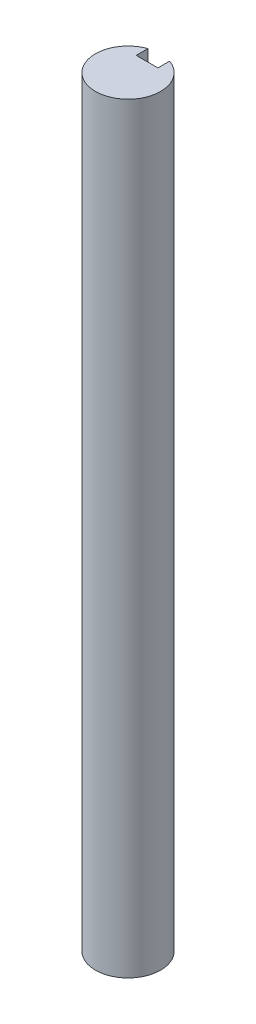
ISO-10303-21;
HEADER;
FILE_DESCRIPTION(('STEP AP214'),'2;1');
FILE_NAME('part.step','',(''),(''),'','','');
FILE_SCHEMA(('AUTOMOTIVE_DESIGN { 1 0 10303 214 1 1 1 1 }'));
ENDSEC;
DATA;
#1=APPLICATION_CONTEXT('core data for automotive mechanical design processes');
#2=APPLICATION_PROTOCOL_DEFINITION('international standard','automotive_design',2000,#1);
#3=PRODUCT_CONTEXT('',#1,'mechanical');
#4=PRODUCT('Part','Part','',(#3));
#5=PRODUCT_RELATED_PRODUCT_CATEGORY('part','',(#4));
#6=PRODUCT_DEFINITION_FORMATION('','',#4);
#7=PRODUCT_DEFINITION_CONTEXT('part definition',#1,'design');
#8=PRODUCT_DEFINITION('design','',#6,#7);
#9=PRODUCT_DEFINITION_SHAPE('','',#8);
#10=(LENGTH_UNIT() NAMED_UNIT(*) SI_UNIT(.MILLI.,.METRE.));
#11=(NAMED_UNIT(*) PLANE_ANGLE_UNIT() SI_UNIT($,.RADIAN.));
#12=(NAMED_UNIT(*) SI_UNIT($,.STERADIAN.) SOLID_ANGLE_UNIT());
#13=UNCERTAINTY_MEASURE_WITH_UNIT(LENGTH_MEASURE(1.E-05),#10,'distance_accuracy_value','');
#14=(GEOMETRIC_REPRESENTATION_CONTEXT(3) GLOBAL_UNCERTAINTY_ASSIGNED_CONTEXT((#13)) GLOBAL_UNIT_ASSIGNED_CONTEXT((#10,
#11,#12)) REPRESENTATION_CONTEXT('',''));
#15=CARTESIAN_POINT('',(0.,0.,0.));
#16=DIRECTION('',(0.,0.,1.));
#17=DIRECTION('',(1.,0.,0.));
#18=AXIS2_PLACEMENT_3D('',#15,#16,#17);
#19=CARTESIAN_POINT('',(0.,-36.,0.));
#20=DIRECTION('',(0.,1.,0.));
#21=DIRECTION('',(0.,0.,-1.));
#22=AXIS2_PLACEMENT_3D('',#19,#20,#21);
#23=PLANE('',#22);
#24=DIRECTION('',(0.,0.,-1.));
#25=VECTOR('',#24,1.);
#26=CARTESIAN_POINT('',(2.,-36.,0.));
#27=LINE('',#26,#25);
#28=CARTESIAN_POINT('',(2.,-36.,-1.));
#29=VERTEX_POINT('',#28);
#30=CARTESIAN_POINT('',(2.,-36.,-5.65685424949238));
#31=VERTEX_POINT('',#30);
#32=EDGE_CURVE('E135',#29,#31,#27,.T.);
#33=ORIENTED_EDGE('',*,*,#32,.T.);
#34=CARTESIAN_POINT('',(0.,-36.,0.));
#35=DIRECTION('',(0.,-1.,0.));
#36=DIRECTION('',(0.,0.,-1.));
#37=AXIS2_PLACEMENT_3D('',#34,#35,#36);
#38=CIRCLE('',#37,6.);
#39=CARTESIAN_POINT('',(-2.,-36.,-5.65685424949238));
#40=VERTEX_POINT('',#39);
#41=EDGE_CURVE('E182',#31,#40,#38,.T.);
#42=ORIENTED_EDGE('',*,*,#41,.T.);
#43=DIRECTION('',(0.,0.,1.));
#44=VECTOR('',#43,1.);
#45=CARTESIAN_POINT('',(-2.,-36.,0.));
#46=LINE('',#45,#44);
#47=CARTESIAN_POINT('',(-2.,-36.,-0.999999999999999));
#48=VERTEX_POINT('',#47);
#49=EDGE_CURVE('E185',#40,#48,#46,.T.);
#50=ORIENTED_EDGE('',*,*,#49,.T.);
#51=DIRECTION('',(-1.,0.,0.));
#52=VECTOR('',#51,1.);
#53=CARTESIAN_POINT('',(0.,-36.,-1.));
#54=LINE('',#53,#52);
#55=EDGE_CURVE('E130',#29,#48,#54,.T.);
#56=ORIENTED_EDGE('',*,*,#55,.F.);
#57=EDGE_LOOP('',(#33,#42,#50,#56));
#58=FACE_BOUND('',#57,.T.);
#59=ADVANCED_FACE('F37',(#58),#23,.F.);
#60=CARTESIAN_POINT('',(0.,-36.,0.));
#61=DIRECTION('',(0.,1.,0.));
#62=DIRECTION('',(0.,0.,-1.));
#63=AXIS2_PLACEMENT_3D('',#60,#61,#62);
#64=CYLINDRICAL_SURFACE('',#63,6.);
#65=CARTESIAN_POINT('',(0.,-16.,0.));
#66=DIRECTION('',(0.,-1.,0.));
#67=DIRECTION('',(0.,0.,-1.));
#68=AXIS2_PLACEMENT_3D('',#65,#66,#67);
#69=CIRCLE('',#68,6.);
#70=CARTESIAN_POINT('',(2.,-16.,-5.65685424949238));
#71=VERTEX_POINT('',#70);
#72=CARTESIAN_POINT('',(-2.,-16.,-5.65685424949238));
#73=VERTEX_POINT('',#72);
#74=EDGE_CURVE('E189',#71,#73,#69,.F.);
#75=ORIENTED_EDGE('',*,*,#74,.T.);
#76=DIRECTION('',(0.,1.,0.));
#77=VECTOR('',#76,1.);
#78=CARTESIAN_POINT('',(-2.,-36.,-5.65685424949238));
#79=LINE('',#78,#77);
#80=EDGE_CURVE('E174',#40,#73,#79,.T.);
#81=ORIENTED_EDGE('',*,*,#80,.F.);
#82=ORIENTED_EDGE('',*,*,#41,.F.);
#83=DIRECTION('',(0.,1.,0.));
#84=VECTOR('',#83,1.);
#85=CARTESIAN_POINT('',(2.,-36.,-5.65685424949238));
#86=LINE('',#85,#84);
#87=EDGE_CURVE('E177',#71,#31,#86,.F.);
#88=ORIENTED_EDGE('',*,*,#87,.F.);
#89=EDGE_LOOP('',(#75,#81,#82,#88));
#90=FACE_BOUND('',#89,.T.);
#91=CARTESIAN_POINT('',(0.,54.,0.));
#92=DIRECTION('',(0.,1.,0.));
#93=DIRECTION('',(0.,0.,1.));
#94=AXIS2_PLACEMENT_3D('',#91,#92,#93);
#95=CIRCLE('',#94,6.);
#96=CARTESIAN_POINT('',(-2.,54.,-5.65685424949238));
#97=VERTEX_POINT('',#96);
#98=CARTESIAN_POINT('',(2.,54.,-5.65685424949238));
#99=VERTEX_POINT('',#98);
#100=EDGE_CURVE('E11',#97,#99,#95,.F.);
#101=ORIENTED_EDGE('',*,*,#100,.T.);
#102=DIRECTION('',(0.,1.,0.));
#103=VECTOR('',#102,1.);
#104=CARTESIAN_POINT('',(2.,-36.,-5.65685424949238));
#105=LINE('',#104,#103);
#106=CARTESIAN_POINT('',(2.,104.,-5.65685424949238));
#107=VERTEX_POINT('',#106);
#108=EDGE_CURVE('E157',#107,#99,#105,.F.);
#109=ORIENTED_EDGE('',*,*,#108,.F.);
#110=CARTESIAN_POINT('',(0.,104.,0.));
#111=DIRECTION('',(0.,-1.,0.));
#112=DIRECTION('',(0.,0.,-1.));
#113=AXIS2_PLACEMENT_3D('',#110,#111,#112);
#114=CIRCLE('',#113,6.);
#115=CARTESIAN_POINT('',(-2.,104.,-5.65685424949238));
#116=VERTEX_POINT('',#115);
#117=EDGE_CURVE('E179',#107,#116,#114,.T.);
#118=ORIENTED_EDGE('',*,*,#117,.T.);
#119=DIRECTION('',(0.,1.,0.));
#120=VECTOR('',#119,1.);
#121=CARTESIAN_POINT('',(-2.,-36.,-5.65685424949238));
#122=LINE('',#121,#120);
#123=EDGE_CURVE('E159',#97,#116,#122,.T.);
#124=ORIENTED_EDGE('',*,*,#123,.F.);
#125=EDGE_LOOP('',(#101,#109,#118,#124));
#126=FACE_BOUND('',#125,.T.);
#127=ADVANCED_FACE('F39',(#90,#126),#64,.T.);
#128=CARTESIAN_POINT('',(0.,104.,0.));
#129=DIRECTION('',(0.,1.,0.));
#130=DIRECTION('',(0.,0.,-1.));
#131=AXIS2_PLACEMENT_3D('',#128,#129,#130);
#132=PLANE('',#131);
#133=ORIENTED_EDGE('',*,*,#117,.F.);
#134=DIRECTION('',(0.,0.,-1.));
#135=VECTOR('',#134,1.);
#136=CARTESIAN_POINT('',(2.,104.,0.));
#137=LINE('',#136,#135);
#138=CARTESIAN_POINT('',(2.,104.,-3.5));
#139=VERTEX_POINT('',#138);
#140=EDGE_CURVE('E60',#139,#107,#137,.T.);
#141=ORIENTED_EDGE('',*,*,#140,.F.);
#142=DIRECTION('',(1.,0.,0.));
#143=VECTOR('',#142,1.);
#144=CARTESIAN_POINT('',(0.,104.,-3.5));
#145=LINE('',#144,#143);
#146=CARTESIAN_POINT('',(-2.,104.,-3.5));
#147=VERTEX_POINT('',#146);
#148=EDGE_CURVE('E137',#147,#139,#145,.T.);
#149=ORIENTED_EDGE('',*,*,#148,.F.);
#150=DIRECTION('',(0.,0.,1.));
#151=VECTOR('',#150,1.);
#152=CARTESIAN_POINT('',(-2.,104.,0.));
#153=LINE('',#152,#151);
#154=EDGE_CURVE('E45',#116,#147,#153,.T.);
#155=ORIENTED_EDGE('',*,*,#154,.F.);
#156=EDGE_LOOP('',(#133,#141,#149,#155));
#157=FACE_BOUND('',#156,.T.);
#158=ADVANCED_FACE('F198',(#157),#132,.T.);
#159=CARTESIAN_POINT('',(0.,-16.,-3.5));
#160=DIRECTION('',(0.,0.,-1.));
#161=DIRECTION('',(1.,0.,0.));
#162=AXIS2_PLACEMENT_3D('',#159,#160,#161);
#163=PLANE('',#162);
#164=DIRECTION('',(-1.,0.,0.));
#165=VECTOR('',#164,1.);
#166=CARTESIAN_POINT('',(0.,-30.,-3.5));
#167=LINE('',#166,#165);
#168=CARTESIAN_POINT('',(2.,-30.,-3.5));
#169=VERTEX_POINT('',#168);
#170=CARTESIAN_POINT('',(-2.,-30.,-3.5));
#171=VERTEX_POINT('',#170);
#172=EDGE_CURVE('E129',#169,#171,#167,.T.);
#173=ORIENTED_EDGE('',*,*,#172,.T.);
#174=DIRECTION('',(0.,-1.,0.));
#175=VECTOR('',#174,1.);
#176=CARTESIAN_POINT('',(-2.,-16.,-3.5));
#177=LINE('',#176,#175);
#178=CARTESIAN_POINT('',(-2.,-16.,-3.5));
#179=VERTEX_POINT('',#178);
#180=EDGE_CURVE('E169',#179,#171,#177,.T.);
#181=ORIENTED_EDGE('',*,*,#180,.F.);
#182=DIRECTION('',(-1.,0.,0.));
#183=VECTOR('',#182,1.);
#184=CARTESIAN_POINT('',(0.,-16.,-3.5));
#185=LINE('',#184,#183);
#186=CARTESIAN_POINT('',(2.,-16.,-3.5));
#187=VERTEX_POINT('',#186);
#188=EDGE_CURVE('E164',#187,#179,#185,.T.);
#189=ORIENTED_EDGE('',*,*,#188,.F.);
#190=DIRECTION('',(0.,-1.,0.));
#191=VECTOR('',#190,1.);
#192=CARTESIAN_POINT('',(2.,-16.,-3.5));
#193=LINE('',#192,#191);
#194=EDGE_CURVE('E172',#187,#169,#193,.T.);
#195=ORIENTED_EDGE('',*,*,#194,.T.);
#196=EDGE_LOOP('',(#173,#181,#189,#195));
#197=FACE_BOUND('',#196,.T.);
#198=ADVANCED_FACE('F225',(#197),#163,.T.);
#199=CARTESIAN_POINT('',(2.,-16.,0.));
#200=DIRECTION('',(-1.,0.,0.));
#201=DIRECTION('',(0.,0.,-1.));
#202=AXIS2_PLACEMENT_3D('',#199,#200,#201);
#203=PLANE('',#202);
#204=ORIENTED_EDGE('',*,*,#194,.F.);
#205=DIRECTION('',(0.,0.,1.));
#206=VECTOR('',#205,1.);
#207=CARTESIAN_POINT('',(2.,-16.,0.));
#208=LINE('',#207,#206);
#209=EDGE_CURVE('E162',#71,#187,#208,.T.);
#210=ORIENTED_EDGE('',*,*,#209,.F.);
#211=ORIENTED_EDGE('',*,*,#87,.T.);
#212=ORIENTED_EDGE('',*,*,#32,.F.);
#213=DIRECTION('',(0.,-1.,0.));
#214=VECTOR('',#213,1.);
#215=CARTESIAN_POINT('',(2.,-30.,-1.));
#216=LINE('',#215,#214);
#217=CARTESIAN_POINT('',(2.,-30.,-1.));
#218=VERTEX_POINT('',#217);
#219=EDGE_CURVE('E119',#218,#29,#216,.T.);
#220=ORIENTED_EDGE('',*,*,#219,.F.);
#221=DIRECTION('',(0.,0.,1.));
#222=VECTOR('',#221,1.);
#223=CARTESIAN_POINT('',(2.,-30.,0.));
#224=LINE('',#223,#222);
#225=EDGE_CURVE('E52',#169,#218,#224,.T.);
#226=ORIENTED_EDGE('',*,*,#225,.F.);
#227=EDGE_LOOP('',(#204,#210,#211,#212,#220,#226));
#228=FACE_BOUND('',#227,.T.);
#229=ADVANCED_FACE('F133',(#228),#203,.T.);
#230=CARTESIAN_POINT('',(-2.,-16.,0.));
#231=DIRECTION('',(1.,0.,0.));
#232=DIRECTION('',(0.,0.,1.));
#233=AXIS2_PLACEMENT_3D('',#230,#231,#232);
#234=PLANE('',#233);
#235=DIRECTION('',(0.,0.,-1.));
#236=VECTOR('',#235,1.);
#237=CARTESIAN_POINT('',(-2.,-16.,0.));
#238=LINE('',#237,#236);
#239=EDGE_CURVE('E167',#179,#73,#238,.T.);
#240=ORIENTED_EDGE('',*,*,#239,.F.);
#241=ORIENTED_EDGE('',*,*,#180,.T.);
#242=DIRECTION('',(0.,0.,-1.));
#243=VECTOR('',#242,1.);
#244=CARTESIAN_POINT('',(-2.,-30.,0.));
#245=LINE('',#244,#243);
#246=CARTESIAN_POINT('',(-2.,-30.,-0.999999999999999));
#247=VERTEX_POINT('',#246);
#248=EDGE_CURVE('E124',#247,#171,#245,.T.);
#249=ORIENTED_EDGE('',*,*,#248,.F.);
#250=DIRECTION('',(0.,-1.,0.));
#251=VECTOR('',#250,1.);
#252=CARTESIAN_POINT('',(-2.,-30.,-0.999999999999999));
#253=LINE('',#252,#251);
#254=EDGE_CURVE('E121',#247,#48,#253,.T.);
#255=ORIENTED_EDGE('',*,*,#254,.T.);
#256=ORIENTED_EDGE('',*,*,#49,.F.);
#257=ORIENTED_EDGE('',*,*,#80,.T.);
#258=EDGE_LOOP('',(#240,#241,#249,#255,#256,#257));
#259=FACE_BOUND('',#258,.T.);
#260=ADVANCED_FACE('F228',(#259),#234,.T.);
#261=CARTESIAN_POINT('',(0.,-16.,0.));
#262=DIRECTION('',(0.,1.,0.));
#263=DIRECTION('',(0.,0.,-1.));
#264=AXIS2_PLACEMENT_3D('',#261,#262,#263);
#265=PLANE('',#264);
#266=ORIENTED_EDGE('',*,*,#74,.F.);
#267=ORIENTED_EDGE('',*,*,#209,.T.);
#268=ORIENTED_EDGE('',*,*,#188,.T.);
#269=ORIENTED_EDGE('',*,*,#239,.T.);
#270=EDGE_LOOP('',(#266,#267,#268,#269));
#271=FACE_BOUND('',#270,.T.);
#272=ADVANCED_FACE('F234',(#271),#265,.F.);
#273=CARTESIAN_POINT('',(-2.,54.,0.));
#274=DIRECTION('',(1.,0.,0.));
#275=DIRECTION('',(0.,0.,1.));
#276=AXIS2_PLACEMENT_3D('',#273,#274,#275);
#277=PLANE('',#276);
#278=DIRECTION('',(0.,0.,1.));
#279=VECTOR('',#278,1.);
#280=CARTESIAN_POINT('',(-2.,54.,0.));
#281=LINE('',#280,#279);
#282=CARTESIAN_POINT('',(-2.,54.,-3.5));
#283=VERTEX_POINT('',#282);
#284=EDGE_CURVE('E142',#97,#283,#281,.T.);
#285=ORIENTED_EDGE('',*,*,#284,.F.);
#286=ORIENTED_EDGE('',*,*,#123,.T.);
#287=ORIENTED_EDGE('',*,*,#154,.T.);
#288=DIRECTION('',(0.,1.,0.));
#289=VECTOR('',#288,1.);
#290=CARTESIAN_POINT('',(-2.,54.,-3.5));
#291=LINE('',#290,#289);
#292=EDGE_CURVE('E155',#283,#147,#291,.T.);
#293=ORIENTED_EDGE('',*,*,#292,.F.);
#294=EDGE_LOOP('',(#285,#286,#287,#293));
#295=FACE_BOUND('',#294,.T.);
#296=ADVANCED_FACE('F195',(#295),#277,.T.);
#297=CARTESIAN_POINT('',(0.,54.,-3.5));
#298=DIRECTION('',(0.,0.,-1.));
#299=DIRECTION('',(1.,0.,0.));
#300=AXIS2_PLACEMENT_3D('',#297,#298,#299);
#301=PLANE('',#300);
#302=ORIENTED_EDGE('',*,*,#148,.T.);
#303=DIRECTION('',(0.,1.,0.));
#304=VECTOR('',#303,1.);
#305=CARTESIAN_POINT('',(2.,54.,-3.5));
#306=LINE('',#305,#304);
#307=CARTESIAN_POINT('',(2.,54.,-3.5));
#308=VERTEX_POINT('',#307);
#309=EDGE_CURVE('E150',#308,#139,#306,.T.);
#310=ORIENTED_EDGE('',*,*,#309,.F.);
#311=DIRECTION('',(1.,0.,0.));
#312=VECTOR('',#311,1.);
#313=CARTESIAN_POINT('',(0.,54.,-3.5));
#314=LINE('',#313,#312);
#315=EDGE_CURVE('E145',#283,#308,#314,.T.);
#316=ORIENTED_EDGE('',*,*,#315,.F.);
#317=ORIENTED_EDGE('',*,*,#292,.T.);
#318=EDGE_LOOP('',(#302,#310,#316,#317));
#319=FACE_BOUND('',#318,.T.);
#320=ADVANCED_FACE('F201',(#319),#301,.T.);
#321=CARTESIAN_POINT('',(2.,54.,0.));
#322=DIRECTION('',(-1.,0.,0.));
#323=DIRECTION('',(0.,0.,-1.));
#324=AXIS2_PLACEMENT_3D('',#321,#322,#323);
#325=PLANE('',#324);
#326=ORIENTED_EDGE('',*,*,#140,.T.);
#327=ORIENTED_EDGE('',*,*,#108,.T.);
#328=DIRECTION('',(0.,0.,-1.));
#329=VECTOR('',#328,1.);
#330=CARTESIAN_POINT('',(2.,54.,0.));
#331=LINE('',#330,#329);
#332=EDGE_CURVE('E148',#308,#99,#331,.T.);
#333=ORIENTED_EDGE('',*,*,#332,.F.);
#334=ORIENTED_EDGE('',*,*,#309,.T.);
#335=EDGE_LOOP('',(#326,#327,#333,#334));
#336=FACE_BOUND('',#335,.T.);
#337=ADVANCED_FACE('F207',(#336),#325,.T.);
#338=CARTESIAN_POINT('',(0.,54.,0.));
#339=DIRECTION('',(0.,-1.,0.));
#340=DIRECTION('',(0.,0.,1.));
#341=AXIS2_PLACEMENT_3D('',#338,#339,#340);
#342=PLANE('',#341);
#343=ORIENTED_EDGE('',*,*,#100,.F.);
#344=ORIENTED_EDGE('',*,*,#284,.T.);
#345=ORIENTED_EDGE('',*,*,#315,.T.);
#346=ORIENTED_EDGE('',*,*,#332,.T.);
#347=EDGE_LOOP('',(#343,#344,#345,#346));
#348=FACE_BOUND('',#347,.T.);
#349=ADVANCED_FACE('F204',(#348),#342,.F.);
#350=CARTESIAN_POINT('',(0.,-30.,-1.));
#351=DIRECTION('',(0.,0.,-1.));
#352=DIRECTION('',(1.,0.,0.));
#353=AXIS2_PLACEMENT_3D('',#350,#351,#352);
#354=PLANE('',#353);
#355=ORIENTED_EDGE('',*,*,#55,.T.);
#356=ORIENTED_EDGE('',*,*,#254,.F.);
#357=DIRECTION('',(-1.,0.,0.));
#358=VECTOR('',#357,1.);
#359=CARTESIAN_POINT('',(0.,-30.,-1.));
#360=LINE('',#359,#358);
#361=EDGE_CURVE('E116',#218,#247,#360,.T.);
#362=ORIENTED_EDGE('',*,*,#361,.F.);
#363=ORIENTED_EDGE('',*,*,#219,.T.);
#364=EDGE_LOOP('',(#355,#356,#362,#363));
#365=FACE_BOUND('',#364,.T.);
#366=ADVANCED_FACE('F118',(#365),#354,.T.);
#367=CARTESIAN_POINT('',(0.,-30.,0.));
#368=DIRECTION('',(0.,1.,0.));
#369=DIRECTION('',(0.,0.,-1.));
#370=AXIS2_PLACEMENT_3D('',#367,#368,#369);
#371=PLANE('',#370);
#372=ORIENTED_EDGE('',*,*,#172,.F.);
#373=ORIENTED_EDGE('',*,*,#225,.T.);
#374=ORIENTED_EDGE('',*,*,#361,.T.);
#375=ORIENTED_EDGE('',*,*,#248,.T.);
#376=EDGE_LOOP('',(#372,#373,#374,#375));
#377=FACE_BOUND('',#376,.T.);
#378=ADVANCED_FACE('F127',(#377),#371,.F.);
#379=CLOSED_SHELL('',(#59,#127,#158,#198,#229,#260,#272,#296,#320,#337,#349,#366,#378));
#380=MANIFOLD_SOLID_BREP('B2',#379);
#381=ADVANCED_BREP_SHAPE_REPRESENTATION('',(#18,#380),#14);
#382=SHAPE_DEFINITION_REPRESENTATION(#9,#381);
ENDSEC;
END-ISO-10303-21;
